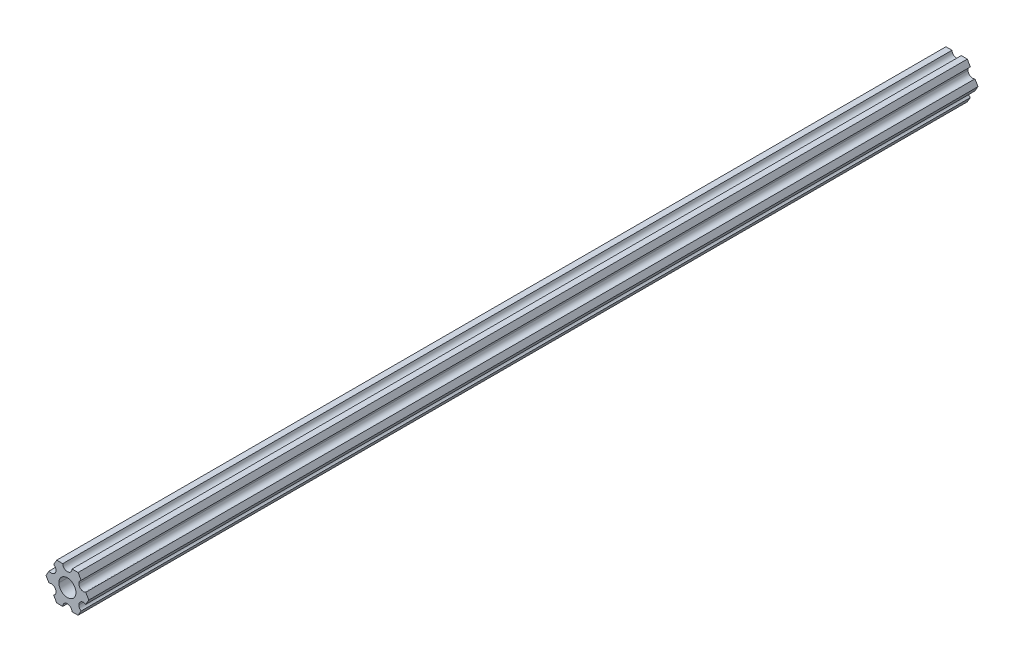
ISO-10303-21;
HEADER;
FILE_DESCRIPTION(('STEP AP214'),'2;1');
FILE_NAME('part.step','',(''),(''),'','','');
FILE_SCHEMA(('AUTOMOTIVE_DESIGN { 1 0 10303 214 1 1 1 1 }'));
ENDSEC;
DATA;
#1=APPLICATION_CONTEXT('core data for automotive mechanical design processes');
#2=APPLICATION_PROTOCOL_DEFINITION('international standard','automotive_design',2000,#1);
#3=PRODUCT_CONTEXT('',#1,'mechanical');
#4=PRODUCT('Part','Part','',(#3));
#5=PRODUCT_RELATED_PRODUCT_CATEGORY('part','',(#4));
#6=PRODUCT_DEFINITION_FORMATION('','',#4);
#7=PRODUCT_DEFINITION_CONTEXT('part definition',#1,'design');
#8=PRODUCT_DEFINITION('design','',#6,#7);
#9=PRODUCT_DEFINITION_SHAPE('','',#8);
#10=(LENGTH_UNIT() NAMED_UNIT(*) SI_UNIT(.MILLI.,.METRE.));
#11=(NAMED_UNIT(*) PLANE_ANGLE_UNIT() SI_UNIT($,.RADIAN.));
#12=(NAMED_UNIT(*) SI_UNIT($,.STERADIAN.) SOLID_ANGLE_UNIT());
#13=UNCERTAINTY_MEASURE_WITH_UNIT(LENGTH_MEASURE(1.E-05),#10,'distance_accuracy_value','');
#14=(GEOMETRIC_REPRESENTATION_CONTEXT(3) GLOBAL_UNCERTAINTY_ASSIGNED_CONTEXT((#13)) GLOBAL_UNIT_ASSIGNED_CONTEXT((#10,
#11,#12)) REPRESENTATION_CONTEXT('',''));
#15=CARTESIAN_POINT('',(0.,0.,0.));
#16=DIRECTION('',(0.,0.,1.));
#17=DIRECTION('',(1.,0.,0.));
#18=AXIS2_PLACEMENT_3D('',#15,#16,#17);
#19=CARTESIAN_POINT('',(0.,0.,304.8));
#20=DIRECTION('',(0.,0.,-1.));
#21=DIRECTION('',(-1.,0.,0.));
#22=AXIS2_PLACEMENT_3D('',#19,#20,#21);
#23=CYLINDRICAL_SURFACE('',#22,2.9337);
#24=DIRECTION('',(0.,0.,-1.));
#25=VECTOR('',#24,1.);
#26=CARTESIAN_POINT('',(2.9337,0.,304.8));
#27=LINE('',#26,#25);
#28=CARTESIAN_POINT('',(2.9337,0.,304.8));
#29=VERTEX_POINT('',#28);
#30=CARTESIAN_POINT('',(2.9337,0.,0.));
#31=VERTEX_POINT('',#30);
#32=EDGE_CURVE('E251',#29,#31,#27,.T.);
#33=ORIENTED_EDGE('',*,*,#32,.F.);
#34=CARTESIAN_POINT('',(0.,0.,304.8));
#35=DIRECTION('',(0.,0.,1.));
#36=DIRECTION('',(1.,0.,0.));
#37=AXIS2_PLACEMENT_3D('',#34,#35,#36);
#38=CIRCLE('',#37,2.9337);
#39=CARTESIAN_POINT('',(-2.9337,0.,304.8));
#40=VERTEX_POINT('',#39);
#41=EDGE_CURVE('E218',#29,#40,#38,.T.);
#42=ORIENTED_EDGE('',*,*,#41,.T.);
#43=DIRECTION('',(0.,0.,-1.));
#44=VECTOR('',#43,1.);
#45=CARTESIAN_POINT('',(-2.9337,0.,304.8));
#46=LINE('',#45,#44);
#47=CARTESIAN_POINT('',(-2.9337,0.,0.));
#48=VERTEX_POINT('',#47);
#49=EDGE_CURVE('E250',#40,#48,#46,.T.);
#50=ORIENTED_EDGE('',*,*,#49,.T.);
#51=CARTESIAN_POINT('',(0.,0.,0.));
#52=DIRECTION('',(0.,0.,1.));
#53=DIRECTION('',(1.,0.,0.));
#54=AXIS2_PLACEMENT_3D('',#51,#52,#53);
#55=CIRCLE('',#54,2.9337);
#56=EDGE_CURVE('E252',#31,#48,#55,.T.);
#57=ORIENTED_EDGE('',*,*,#56,.F.);
#58=EDGE_LOOP('',(#33,#42,#50,#57));
#59=FACE_BOUND('',#58,.T.);
#60=ADVANCED_FACE('F16',(#59),#23,.F.);
#61=CARTESIAN_POINT('',(5.49926150638082,-3.17499966684067,304.8));
#62=DIRECTION('',(0.,0.,-1.));
#63=DIRECTION('',(-1.,0.,0.));
#64=AXIS2_PLACEMENT_3D('',#61,#62,#63);
#65=CYLINDRICAL_SURFACE('',#64,1.5875);
#66=DIRECTION('',(0.,0.,-1.));
#67=VECTOR('',#66,1.);
#68=CARTESIAN_POINT('',(3.91176150638082,-3.17499966684067,304.8));
#69=LINE('',#68,#67);
#70=CARTESIAN_POINT('',(3.91176150638082,-3.17499966684067,304.8));
#71=VERTEX_POINT('',#70);
#72=CARTESIAN_POINT('',(3.91176150638082,-3.17499966684067,0.));
#73=VERTEX_POINT('',#72);
#74=EDGE_CURVE('E231',#71,#73,#69,.T.);
#75=ORIENTED_EDGE('',*,*,#74,.F.);
#76=CARTESIAN_POINT('',(5.49926150638082,-3.17499966684067,304.8));
#77=DIRECTION('',(0.,0.,-1.));
#78=DIRECTION('',(1.,0.,0.));
#79=AXIS2_PLACEMENT_3D('',#76,#77,#78);
#80=CIRCLE('',#79,1.5875);
#81=CARTESIAN_POINT('',(4.70551158967065,-4.54981504343587,304.8));
#82=VERTEX_POINT('',#81);
#83=EDGE_CURVE('E255',#82,#71,#80,.T.);
#84=ORIENTED_EDGE('',*,*,#83,.F.);
#85=DIRECTION('',(0.,0.,-1.));
#86=VECTOR('',#85,1.);
#87=CARTESIAN_POINT('',(4.70551158967065,-4.54981504343587,304.8));
#88=LINE('',#87,#86);
#89=CARTESIAN_POINT('',(4.70551158967065,-4.54981504343587,0.));
#90=VERTEX_POINT('',#89);
#91=EDGE_CURVE('E10',#82,#90,#88,.T.);
#92=ORIENTED_EDGE('',*,*,#91,.T.);
#93=CARTESIAN_POINT('',(5.49926150638082,-3.17499966684067,0.));
#94=DIRECTION('',(0.,0.,-1.));
#95=DIRECTION('',(1.,0.,0.));
#96=AXIS2_PLACEMENT_3D('',#93,#94,#95);
#97=CIRCLE('',#96,1.5875);
#98=EDGE_CURVE('E217',#90,#73,#97,.T.);
#99=ORIENTED_EDGE('',*,*,#98,.T.);
#100=EDGE_LOOP('',(#75,#84,#92,#99));
#101=FACE_BOUND('',#100,.T.);
#102=ADVANCED_FACE('F509',(#101),#65,.F.);
#103=CARTESIAN_POINT('',(3.66617459405346,-6.34999977789375,304.8));
#104=DIRECTION('',(-0.86602543407573,0.499999947533941,0.));
#105=DIRECTION('',(0.,0.,1.));
#106=AXIS2_PLACEMENT_3D('',#103,#104,#105);
#107=PLANE('',#106);
#108=DIRECTION('',(0.499999947533941,0.86602543407573,0.));
#109=VECTOR('',#108,1.);
#110=CARTESIAN_POINT('',(3.66617459405346,-6.34999977789375,0.));
#111=LINE('',#110,#109);
#112=CARTESIAN_POINT('',(3.66617459405346,-6.34999977789375,0.));
#113=VERTEX_POINT('',#112);
#114=EDGE_CURVE('E374',#113,#90,#111,.T.);
#115=ORIENTED_EDGE('',*,*,#114,.T.);
#116=ORIENTED_EDGE('',*,*,#91,.F.);
#117=DIRECTION('',(0.499999947533941,0.86602543407573,0.));
#118=VECTOR('',#117,1.);
#119=CARTESIAN_POINT('',(3.66617459405346,-6.34999977789375,304.8));
#120=LINE('',#119,#118);
#121=CARTESIAN_POINT('',(3.66617459405346,-6.34999977789375,304.8));
#122=VERTEX_POINT('',#121);
#123=EDGE_CURVE('E258',#122,#82,#120,.T.);
#124=ORIENTED_EDGE('',*,*,#123,.F.);
#125=DIRECTION('',(0.,0.,-1.));
#126=VECTOR('',#125,1.);
#127=CARTESIAN_POINT('',(3.66617459405346,-6.34999977789375,304.8));
#128=LINE('',#127,#126);
#129=EDGE_CURVE('E27',#122,#113,#128,.T.);
#130=ORIENTED_EDGE('',*,*,#129,.T.);
#131=EDGE_LOOP('',(#115,#116,#124,#130));
#132=FACE_BOUND('',#131,.T.);
#133=ADVANCED_FACE('F462',(#132),#107,.F.);
#134=CARTESIAN_POINT('',(1.58750038469926,-6.34999990382518,304.8));
#135=DIRECTION('',(-6.05825721258438E-08,1.,0.));
#136=DIRECTION('',(0.,0.,1.));
#137=AXIS2_PLACEMENT_3D('',#134,#135,#136);
#138=PLANE('',#137);
#139=DIRECTION('',(1.,6.05825721258438E-08,0.));
#140=VECTOR('',#139,1.);
#141=CARTESIAN_POINT('',(1.58750038469926,-6.34999990382518,0.));
#142=LINE('',#141,#140);
#143=CARTESIAN_POINT('',(1.58750038469926,-6.34999990382518,0.));
#144=VERTEX_POINT('',#143);
#145=EDGE_CURVE('E348',#144,#113,#142,.T.);
#146=ORIENTED_EDGE('',*,*,#145,.T.);
#147=ORIENTED_EDGE('',*,*,#129,.F.);
#148=DIRECTION('',(1.,6.05825721258438E-08,0.));
#149=VECTOR('',#148,1.);
#150=CARTESIAN_POINT('',(1.58750038469926,-6.34999990382518,304.8));
#151=LINE('',#150,#149);
#152=CARTESIAN_POINT('',(1.58750038469926,-6.34999990382518,304.8));
#153=VERTEX_POINT('',#152);
#154=EDGE_CURVE('E299',#153,#122,#151,.T.);
#155=ORIENTED_EDGE('',*,*,#154,.F.);
#156=DIRECTION('',(0.,0.,-1.));
#157=VECTOR('',#156,1.);
#158=CARTESIAN_POINT('',(1.58750038469926,-6.34999990382518,304.8));
#159=LINE('',#158,#157);
#160=EDGE_CURVE('E307',#153,#144,#159,.T.);
#161=ORIENTED_EDGE('',*,*,#160,.T.);
#162=EDGE_LOOP('',(#146,#147,#155,#161));
#163=FACE_BOUND('',#162,.T.);
#164=ADVANCED_FACE('F456',(#163),#138,.F.);
#165=CARTESIAN_POINT('',(3.8469926204343E-07,-6.35,304.8));
#166=DIRECTION('',(0.,0.,-1.));
#167=DIRECTION('',(-1.,0.,0.));
#168=AXIS2_PLACEMENT_3D('',#165,#166,#167);
#169=CYLINDRICAL_SURFACE('',#168,1.5875);
#170=CARTESIAN_POINT('',(3.8469926204343E-07,-6.35,0.));
#171=DIRECTION('',(0.,0.,-1.));
#172=DIRECTION('',(1.,0.,0.));
#173=AXIS2_PLACEMENT_3D('',#170,#171,#172);
#174=CIRCLE('',#173,1.5875);
#175=CARTESIAN_POINT('',(-1.58749961530073,-6.35000009617482,0.));
#176=VERTEX_POINT('',#175);
#177=EDGE_CURVE('E343',#176,#144,#174,.T.);
#178=ORIENTED_EDGE('',*,*,#177,.T.);
#179=ORIENTED_EDGE('',*,*,#160,.F.);
#180=CARTESIAN_POINT('',(3.8469926204343E-07,-6.35,304.8));
#181=DIRECTION('',(0.,0.,-1.));
#182=DIRECTION('',(1.,0.,0.));
#183=AXIS2_PLACEMENT_3D('',#180,#181,#182);
#184=CIRCLE('',#183,1.5875);
#185=CARTESIAN_POINT('',(-1.58749961530073,-6.35000009617482,304.8));
#186=VERTEX_POINT('',#185);
#187=EDGE_CURVE('E272',#186,#153,#184,.T.);
#188=ORIENTED_EDGE('',*,*,#187,.F.);
#189=DIRECTION('',(0.,0.,-1.));
#190=VECTOR('',#189,1.);
#191=CARTESIAN_POINT('',(-1.58749961530073,-6.35000009617482,304.8));
#192=LINE('',#191,#190);
#193=EDGE_CURVE('E382',#186,#176,#192,.T.);
#194=ORIENTED_EDGE('',*,*,#193,.T.);
#195=EDGE_LOOP('',(#178,#179,#188,#194));
#196=FACE_BOUND('',#195,.T.);
#197=ADVANCED_FACE('F497',(#196),#169,.F.);
#198=CARTESIAN_POINT('',(-3.66617382465481,-6.35000022210628,304.8));
#199=DIRECTION('',(-6.05825854783851E-08,1.,0.));
#200=DIRECTION('',(0.,0.,1.));
#201=AXIS2_PLACEMENT_3D('',#198,#199,#200);
#202=PLANE('',#201);
#203=DIRECTION('',(1.,6.05825854783851E-08,0.));
#204=VECTOR('',#203,1.);
#205=CARTESIAN_POINT('',(-3.66617382465481,-6.35000022210628,0.));
#206=LINE('',#205,#204);
#207=CARTESIAN_POINT('',(-3.66617382465481,-6.35000022210628,0.));
#208=VERTEX_POINT('',#207);
#209=EDGE_CURVE('E347',#208,#176,#206,.T.);
#210=ORIENTED_EDGE('',*,*,#209,.T.);
#211=ORIENTED_EDGE('',*,*,#193,.F.);
#212=DIRECTION('',(1.,6.05825854783851E-08,0.));
#213=VECTOR('',#212,1.);
#214=CARTESIAN_POINT('',(-3.66617382465481,-6.35000022210628,304.8));
#215=LINE('',#214,#213);
#216=CARTESIAN_POINT('',(-3.66617382465481,-6.35000022210628,304.8));
#217=VERTEX_POINT('',#216);
#218=EDGE_CURVE('E268',#217,#186,#215,.T.);
#219=ORIENTED_EDGE('',*,*,#218,.F.);
#220=DIRECTION('',(0.,0.,-1.));
#221=VECTOR('',#220,1.);
#222=CARTESIAN_POINT('',(-3.66617382465481,-6.35000022210628,304.8));
#223=LINE('',#222,#221);
#224=EDGE_CURVE('E422',#217,#208,#223,.T.);
#225=ORIENTED_EDGE('',*,*,#224,.T.);
#226=EDGE_LOOP('',(#210,#211,#219,#225));
#227=FACE_BOUND('',#226,.T.);
#228=ADVANCED_FACE('F490',(#227),#202,.F.);
#229=CARTESIAN_POINT('',(-4.70551103839172,-4.54981561357972,304.8));
#230=DIRECTION('',(0.866025373493152,0.500000052466045,0.));
#231=DIRECTION('',(0.,0.,-1.));
#232=AXIS2_PLACEMENT_3D('',#229,#230,#231);
#233=PLANE('',#232);
#234=DIRECTION('',(0.500000052466045,-0.866025373493152,0.));
#235=VECTOR('',#234,1.);
#236=CARTESIAN_POINT('',(-4.70551103839172,-4.54981561357972,0.));
#237=LINE('',#236,#235);
#238=CARTESIAN_POINT('',(-4.70551103839172,-4.54981561357972,0.));
#239=VERTEX_POINT('',#238);
#240=EDGE_CURVE('E321',#239,#208,#237,.T.);
#241=ORIENTED_EDGE('',*,*,#240,.T.);
#242=ORIENTED_EDGE('',*,*,#224,.F.);
#243=DIRECTION('',(0.500000052466045,-0.866025373493152,0.));
#244=VECTOR('',#243,1.);
#245=CARTESIAN_POINT('',(-4.70551103839172,-4.54981561357972,304.8));
#246=LINE('',#245,#244);
#247=CARTESIAN_POINT('',(-4.70551103839172,-4.54981561357972,304.8));
#248=VERTEX_POINT('',#247);
#249=EDGE_CURVE('E273',#248,#217,#246,.T.);
#250=ORIENTED_EDGE('',*,*,#249,.F.);
#251=DIRECTION('',(0.,0.,-1.));
#252=VECTOR('',#251,1.);
#253=CARTESIAN_POINT('',(-4.70551103839172,-4.54981561357972,304.8));
#254=LINE('',#253,#252);
#255=EDGE_CURVE('E311',#248,#239,#254,.T.);
#256=ORIENTED_EDGE('',*,*,#255,.T.);
#257=EDGE_LOOP('',(#241,#242,#250,#256));
#258=FACE_BOUND('',#257,.T.);
#259=ADVANCED_FACE('F486',(#258),#233,.F.);
#260=CARTESIAN_POINT('',(-5.49926112168156,-3.17500033315934,304.8));
#261=DIRECTION('',(0.,0.,-1.));
#262=DIRECTION('',(-1.,0.,0.));
#263=AXIS2_PLACEMENT_3D('',#260,#261,#262);
#264=CYLINDRICAL_SURFACE('',#263,1.5875);
#265=CARTESIAN_POINT('',(-5.49926112168156,-3.17500033315934,0.));
#266=DIRECTION('',(0.,0.,-1.));
#267=DIRECTION('',(1.,0.,0.));
#268=AXIS2_PLACEMENT_3D('',#265,#266,#267);
#269=CIRCLE('',#268,1.5875);
#270=CARTESIAN_POINT('',(-6.29301120497141,-1.80018505273897,0.));
#271=VERTEX_POINT('',#270);
#272=EDGE_CURVE('E317',#271,#239,#269,.T.);
#273=ORIENTED_EDGE('',*,*,#272,.T.);
#274=ORIENTED_EDGE('',*,*,#255,.F.);
#275=CARTESIAN_POINT('',(-5.49926112168156,-3.17500033315934,304.8));
#276=DIRECTION('',(0.,0.,-1.));
#277=DIRECTION('',(1.,0.,0.));
#278=AXIS2_PLACEMENT_3D('',#275,#276,#277);
#279=CIRCLE('',#278,1.5875);
#280=CARTESIAN_POINT('',(-6.29301120497141,-1.80018505273897,304.8));
#281=VERTEX_POINT('',#280);
#282=EDGE_CURVE('E390',#281,#248,#279,.T.);
#283=ORIENTED_EDGE('',*,*,#282,.F.);
#284=DIRECTION('',(0.,0.,-1.));
#285=VECTOR('',#284,1.);
#286=CARTESIAN_POINT('',(-6.29301120497141,-1.80018505273897,304.8));
#287=LINE('',#286,#285);
#288=EDGE_CURVE('E308',#281,#271,#287,.T.);
#289=ORIENTED_EDGE('',*,*,#288,.T.);
#290=EDGE_LOOP('',(#273,#274,#283,#289));
#291=FACE_BOUND('',#290,.T.);
#292=ADVANCED_FACE('F494',(#291),#264,.F.);
#293=CARTESIAN_POINT('',(-7.33234841870827,-4.44212523790841E-07,304.8));
#294=DIRECTION('',(0.866025373493151,0.500000052466045,0.));
#295=DIRECTION('',(0.,0.,-1.));
#296=AXIS2_PLACEMENT_3D('',#293,#294,#295);
#297=PLANE('',#296);
#298=DIRECTION('',(0.500000052466045,-0.866025373493151,0.));
#299=VECTOR('',#298,1.);
#300=CARTESIAN_POINT('',(-7.33234841870827,-4.44212523790841E-07,0.));
#301=LINE('',#300,#299);
#302=CARTESIAN_POINT('',(-7.33234841870827,-4.44212523790841E-07,0.));
#303=VERTEX_POINT('',#302);
#304=EDGE_CURVE('E279',#303,#271,#301,.T.);
#305=ORIENTED_EDGE('',*,*,#304,.T.);
#306=ORIENTED_EDGE('',*,*,#288,.F.);
#307=DIRECTION('',(0.500000052466045,-0.866025373493151,0.));
#308=VECTOR('',#307,1.);
#309=CARTESIAN_POINT('',(-7.33234841870827,-4.44212523790841E-07,304.8));
#310=LINE('',#309,#308);
#311=CARTESIAN_POINT('',(-7.33234841870827,-4.44212523790841E-07,304.8));
#312=VERTEX_POINT('',#311);
#313=EDGE_CURVE('E290',#312,#281,#310,.T.);
#314=ORIENTED_EDGE('',*,*,#313,.F.);
#315=DIRECTION('',(0.,0.,-1.));
#316=VECTOR('',#315,1.);
#317=CARTESIAN_POINT('',(-7.33234841870827,-4.44212523790841E-07,304.8));
#318=LINE('',#317,#316);
#319=EDGE_CURVE('E266',#312,#303,#318,.T.);
#320=ORIENTED_EDGE('',*,*,#319,.T.);
#321=EDGE_LOOP('',(#305,#306,#314,#320));
#322=FACE_BOUND('',#321,.T.);
#323=ADVANCED_FACE('F536',(#322),#297,.F.);
#324=CARTESIAN_POINT('',(-6.29301142309098,1.80018429024547,304.8));
#325=DIRECTION('',(0.866025434075724,-0.499999947533952,0.));
#326=DIRECTION('',(0.,0.,-1.));
#327=AXIS2_PLACEMENT_3D('',#324,#325,#326);
#328=PLANE('',#327);
#329=DIRECTION('',(-0.499999947533951,-0.866025434075724,0.));
#330=VECTOR('',#329,1.);
#331=CARTESIAN_POINT('',(-6.29301142309098,1.80018429024547,0.));
#332=LINE('',#331,#330);
#333=CARTESIAN_POINT('',(-6.29301142309098,1.80018429024547,0.));
#334=VERTEX_POINT('',#333);
#335=EDGE_CURVE('E274',#334,#303,#332,.T.);
#336=ORIENTED_EDGE('',*,*,#335,.T.);
#337=ORIENTED_EDGE('',*,*,#319,.F.);
#338=DIRECTION('',(-0.499999947533951,-0.866025434075724,0.));
#339=VECTOR('',#338,1.);
#340=CARTESIAN_POINT('',(-6.29301142309098,1.80018429024547,304.8));
#341=LINE('',#340,#339);
#342=CARTESIAN_POINT('',(-6.29301142309098,1.80018429024547,304.8));
#343=VERTEX_POINT('',#342);
#344=EDGE_CURVE('E286',#343,#312,#341,.T.);
#345=ORIENTED_EDGE('',*,*,#344,.F.);
#346=DIRECTION('',(0.,0.,-1.));
#347=VECTOR('',#346,1.);
#348=CARTESIAN_POINT('',(-6.29301142309098,1.80018429024547,304.8));
#349=LINE('',#348,#347);
#350=EDGE_CURVE('E263',#343,#334,#349,.T.);
#351=ORIENTED_EDGE('',*,*,#350,.T.);
#352=EDGE_LOOP('',(#336,#337,#345,#351));
#353=FACE_BOUND('',#352,.T.);
#354=ADVANCED_FACE('F532',(#353),#328,.F.);
#355=CARTESIAN_POINT('',(-5.49926150638082,3.17499966684067,304.8));
#356=DIRECTION('',(0.,0.,-1.));
#357=DIRECTION('',(-1.,0.,0.));
#358=AXIS2_PLACEMENT_3D('',#355,#356,#357);
#359=CYLINDRICAL_SURFACE('',#358,1.5875);
#360=CARTESIAN_POINT('',(-5.49926150638082,3.17499966684067,0.));
#361=DIRECTION('',(0.,0.,-1.));
#362=DIRECTION('',(1.,0.,0.));
#363=AXIS2_PLACEMENT_3D('',#360,#361,#362);
#364=CIRCLE('',#363,1.5875);
#365=CARTESIAN_POINT('',(-4.70551158967065,4.54981504343587,0.));
#366=VERTEX_POINT('',#365);
#367=EDGE_CURVE('E278',#366,#334,#364,.T.);
#368=ORIENTED_EDGE('',*,*,#367,.T.);
#369=ORIENTED_EDGE('',*,*,#350,.F.);
#370=CARTESIAN_POINT('',(-5.49926150638082,3.17499966684067,304.8));
#371=DIRECTION('',(0.,0.,-1.));
#372=DIRECTION('',(1.,0.,0.));
#373=AXIS2_PLACEMENT_3D('',#370,#371,#372);
#374=CIRCLE('',#373,1.5875);
#375=CARTESIAN_POINT('',(-4.70551158967065,4.54981504343587,304.8));
#376=VERTEX_POINT('',#375);
#377=EDGE_CURVE('E291',#376,#343,#374,.T.);
#378=ORIENTED_EDGE('',*,*,#377,.F.);
#379=DIRECTION('',(0.,0.,-1.));
#380=VECTOR('',#379,1.);
#381=CARTESIAN_POINT('',(-4.70551158967065,4.54981504343587,304.8));
#382=LINE('',#381,#380);
#383=EDGE_CURVE('E267',#376,#366,#382,.T.);
#384=ORIENTED_EDGE('',*,*,#383,.T.);
#385=EDGE_LOOP('',(#368,#369,#378,#384));
#386=FACE_BOUND('',#385,.T.);
#387=ADVANCED_FACE('F535',(#386),#359,.F.);
#388=CARTESIAN_POINT('',(-3.66617459405349,6.3499997778937,304.8));
#389=DIRECTION('',(0.866025434075729,-0.499999947533942,0.));
#390=DIRECTION('',(0.,0.,-1.));
#391=AXIS2_PLACEMENT_3D('',#388,#389,#390);
#392=PLANE('',#391);
#393=DIRECTION('',(-0.499999947533943,-0.866025434075729,0.));
#394=VECTOR('',#393,1.);
#395=CARTESIAN_POINT('',(-3.66617459405349,6.3499997778937,0.));
#396=LINE('',#395,#394);
#397=CARTESIAN_POINT('',(-3.66617459405349,6.3499997778937,0.));
#398=VERTEX_POINT('',#397);
#399=EDGE_CURVE('E316',#398,#366,#396,.T.);
#400=ORIENTED_EDGE('',*,*,#399,.T.);
#401=ORIENTED_EDGE('',*,*,#383,.F.);
#402=DIRECTION('',(-0.499999947533943,-0.866025434075729,0.));
#403=VECTOR('',#402,1.);
#404=CARTESIAN_POINT('',(-3.66617459405349,6.3499997778937,304.8));
#405=LINE('',#404,#403);
#406=CARTESIAN_POINT('',(-3.66617459405349,6.3499997778937,304.8));
#407=VERTEX_POINT('',#406);
#408=EDGE_CURVE('E341',#407,#376,#405,.T.);
#409=ORIENTED_EDGE('',*,*,#408,.F.);
#410=DIRECTION('',(0.,0.,-1.));
#411=VECTOR('',#410,1.);
#412=CARTESIAN_POINT('',(-3.66617459405349,6.3499997778937,304.8));
#413=LINE('',#412,#411);
#414=EDGE_CURVE('E389',#407,#398,#413,.T.);
#415=ORIENTED_EDGE('',*,*,#414,.T.);
#416=EDGE_LOOP('',(#400,#401,#409,#415));
#417=FACE_BOUND('',#416,.T.);
#418=ADVANCED_FACE('F562',(#417),#392,.F.);
#419=CARTESIAN_POINT('',(-1.58750038469926,6.34999990382518,304.8));
#420=DIRECTION('',(6.05825963273174E-08,-1.,0.));
#421=DIRECTION('',(0.,0.,-1.));
#422=AXIS2_PLACEMENT_3D('',#419,#420,#421);
#423=PLANE('',#422);
#424=DIRECTION('',(-1.,-6.05825963273174E-08,0.));
#425=VECTOR('',#424,1.);
#426=CARTESIAN_POINT('',(-1.58750038469926,6.34999990382518,0.));
#427=LINE('',#426,#425);
#428=CARTESIAN_POINT('',(-1.58750038469926,6.34999990382519,0.));
#429=VERTEX_POINT('',#428);
#430=EDGE_CURVE('E312',#429,#398,#427,.T.);
#431=ORIENTED_EDGE('',*,*,#430,.T.);
#432=ORIENTED_EDGE('',*,*,#414,.F.);
#433=DIRECTION('',(-1.,-6.05825963273174E-08,0.));
#434=VECTOR('',#433,1.);
#435=CARTESIAN_POINT('',(-1.58750038469926,6.34999990382518,304.8));
#436=LINE('',#435,#434);
#437=CARTESIAN_POINT('',(-1.58750038469926,6.34999990382519,304.8));
#438=VERTEX_POINT('',#437);
#439=EDGE_CURVE('E337',#438,#407,#436,.T.);
#440=ORIENTED_EDGE('',*,*,#439,.F.);
#441=DIRECTION('',(0.,0.,-1.));
#442=VECTOR('',#441,1.);
#443=CARTESIAN_POINT('',(-1.58750038469926,6.34999990382519,304.8));
#444=LINE('',#443,#442);
#445=EDGE_CURVE('E304',#438,#429,#444,.T.);
#446=ORIENTED_EDGE('',*,*,#445,.T.);
#447=EDGE_LOOP('',(#431,#432,#440,#446));
#448=FACE_BOUND('',#447,.T.);
#449=ADVANCED_FACE('F558',(#448),#423,.F.);
#450=CARTESIAN_POINT('',(-3.84699260060323E-07,6.35,304.8));
#451=DIRECTION('',(0.,0.,-1.));
#452=DIRECTION('',(-1.,0.,0.));
#453=AXIS2_PLACEMENT_3D('',#450,#451,#452);
#454=CYLINDRICAL_SURFACE('',#453,1.5875);
#455=CARTESIAN_POINT('',(-3.84699260060323E-07,6.35,0.));
#456=DIRECTION('',(0.,0.,-1.));
#457=DIRECTION('',(1.,0.,0.));
#458=AXIS2_PLACEMENT_3D('',#455,#456,#457);
#459=CIRCLE('',#458,1.5875);
#460=CARTESIAN_POINT('',(1.58749961530074,6.35000009617482,0.));
#461=VERTEX_POINT('',#460);
#462=EDGE_CURVE('E245',#461,#429,#459,.T.);
#463=ORIENTED_EDGE('',*,*,#462,.T.);
#464=ORIENTED_EDGE('',*,*,#445,.F.);
#465=CARTESIAN_POINT('',(-3.84699260060323E-07,6.35,304.8));
#466=DIRECTION('',(0.,0.,-1.));
#467=DIRECTION('',(1.,0.,0.));
#468=AXIS2_PLACEMENT_3D('',#465,#466,#467);
#469=CIRCLE('',#468,1.5875);
#470=CARTESIAN_POINT('',(1.58749961530074,6.35000009617482,304.8));
#471=VERTEX_POINT('',#470);
#472=EDGE_CURVE('E342',#471,#438,#469,.T.);
#473=ORIENTED_EDGE('',*,*,#472,.F.);
#474=DIRECTION('',(0.,0.,-1.));
#475=VECTOR('',#474,1.);
#476=CARTESIAN_POINT('',(1.58749961530074,6.35000009617482,304.8));
#477=LINE('',#476,#475);
#478=EDGE_CURVE('E262',#471,#461,#477,.T.);
#479=ORIENTED_EDGE('',*,*,#478,.T.);
#480=EDGE_LOOP('',(#463,#464,#473,#479));
#481=FACE_BOUND('',#480,.T.);
#482=ADVANCED_FACE('F555',(#481),#454,.F.);
#483=CARTESIAN_POINT('',(3.66617382465481,6.35000022210627,304.8));
#484=DIRECTION('',(6.05825850611185E-08,-1.,0.));
#485=DIRECTION('',(0.,0.,-1.));
#486=AXIS2_PLACEMENT_3D('',#483,#484,#485);
#487=PLANE('',#486);
#488=DIRECTION('',(-1.,-6.05825850611185E-08,0.));
#489=VECTOR('',#488,1.);
#490=CARTESIAN_POINT('',(3.66617382465481,6.35000022210627,0.));
#491=LINE('',#490,#489);
#492=CARTESIAN_POINT('',(3.66617382465481,6.35000022210627,0.));
#493=VERTEX_POINT('',#492);
#494=EDGE_CURVE('E240',#493,#461,#491,.T.);
#495=ORIENTED_EDGE('',*,*,#494,.T.);
#496=ORIENTED_EDGE('',*,*,#478,.F.);
#497=DIRECTION('',(-1.,-6.05825850611185E-08,0.));
#498=VECTOR('',#497,1.);
#499=CARTESIAN_POINT('',(3.66617382465481,6.35000022210627,304.8));
#500=LINE('',#499,#498);
#501=CARTESIAN_POINT('',(3.66617382465481,6.35000022210627,304.8));
#502=VERTEX_POINT('',#501);
#503=EDGE_CURVE('E361',#502,#471,#500,.T.);
#504=ORIENTED_EDGE('',*,*,#503,.F.);
#505=DIRECTION('',(0.,0.,-1.));
#506=VECTOR('',#505,1.);
#507=CARTESIAN_POINT('',(3.66617382465481,6.35000022210627,304.8));
#508=LINE('',#507,#506);
#509=EDGE_CURVE('E259',#502,#493,#508,.T.);
#510=ORIENTED_EDGE('',*,*,#509,.T.);
#511=EDGE_LOOP('',(#495,#496,#504,#510));
#512=FACE_BOUND('',#511,.T.);
#513=ADVANCED_FACE('F521',(#512),#487,.F.);
#514=CARTESIAN_POINT('',(4.70551103839172,4.54981561357972,304.8));
#515=DIRECTION('',(-0.866025373493151,-0.500000052466046,0.));
#516=DIRECTION('',(-0.500000052466046,0.866025373493151,0.));
#517=AXIS2_PLACEMENT_3D('',#514,#515,#516);
#518=PLANE('',#517);
#519=DIRECTION('',(-0.500000052466046,0.866025373493151,0.));
#520=VECTOR('',#519,1.);
#521=CARTESIAN_POINT('',(4.70551103839172,4.54981561357972,0.));
#522=LINE('',#521,#520);
#523=CARTESIAN_POINT('',(4.70551103839172,4.54981561357972,0.));
#524=VERTEX_POINT('',#523);
#525=EDGE_CURVE('E244',#524,#493,#522,.T.);
#526=ORIENTED_EDGE('',*,*,#525,.T.);
#527=ORIENTED_EDGE('',*,*,#509,.F.);
#528=DIRECTION('',(-0.500000052466046,0.866025373493151,0.));
#529=VECTOR('',#528,1.);
#530=CARTESIAN_POINT('',(4.70551103839172,4.54981561357972,304.8));
#531=LINE('',#530,#529);
#532=CARTESIAN_POINT('',(4.70551103839172,4.54981561357972,304.8));
#533=VERTEX_POINT('',#532);
#534=EDGE_CURVE('E358',#533,#502,#531,.T.);
#535=ORIENTED_EDGE('',*,*,#534,.F.);
#536=DIRECTION('',(0.,0.,-1.));
#537=VECTOR('',#536,1.);
#538=CARTESIAN_POINT('',(4.70551103839172,4.54981561357972,304.8));
#539=LINE('',#538,#537);
#540=EDGE_CURVE('E336',#533,#524,#539,.T.);
#541=ORIENTED_EDGE('',*,*,#540,.T.);
#542=EDGE_LOOP('',(#526,#527,#535,#541));
#543=FACE_BOUND('',#542,.T.);
#544=ADVANCED_FACE('F517',(#543),#518,.F.);
#545=CARTESIAN_POINT('',(5.49926112168156,3.17500033315934,304.8));
#546=DIRECTION('',(0.,0.,-1.));
#547=DIRECTION('',(-1.,0.,0.));
#548=AXIS2_PLACEMENT_3D('',#545,#546,#547);
#549=CYLINDRICAL_SURFACE('',#548,1.5875);
#550=DIRECTION('',(0.,0.,-1.));
#551=VECTOR('',#550,1.);
#552=CARTESIAN_POINT('',(3.91176112168156,3.17500033315934,304.8));
#553=LINE('',#552,#551);
#554=CARTESIAN_POINT('',(3.91176112168156,3.17500033315934,304.8));
#555=VERTEX_POINT('',#554);
#556=CARTESIAN_POINT('',(3.91176112168156,3.17500033315934,0.));
#557=VERTEX_POINT('',#556);
#558=EDGE_CURVE('E325',#555,#557,#553,.T.);
#559=ORIENTED_EDGE('',*,*,#558,.F.);
#560=CARTESIAN_POINT('',(5.49926112168156,3.17500033315934,304.8));
#561=DIRECTION('',(0.,0.,-1.));
#562=DIRECTION('',(1.,0.,0.));
#563=AXIS2_PLACEMENT_3D('',#560,#561,#562);
#564=CIRCLE('',#563,1.5875);
#565=CARTESIAN_POINT('',(6.29301120497139,1.80018505273894,304.8));
#566=VERTEX_POINT('',#565);
#567=EDGE_CURVE('E362',#566,#555,#564,.T.);
#568=ORIENTED_EDGE('',*,*,#567,.F.);
#569=DIRECTION('',(0.,0.,-1.));
#570=VECTOR('',#569,1.);
#571=CARTESIAN_POINT('',(6.29301120497139,1.80018505273894,304.8));
#572=LINE('',#571,#570);
#573=CARTESIAN_POINT('',(6.29301120497139,1.80018505273894,0.));
#574=VERTEX_POINT('',#573);
#575=EDGE_CURVE('E42',#566,#574,#572,.T.);
#576=ORIENTED_EDGE('',*,*,#575,.T.);
#577=CARTESIAN_POINT('',(5.49926112168156,3.17500033315934,0.));
#578=DIRECTION('',(0.,0.,-1.));
#579=DIRECTION('',(1.,0.,0.));
#580=AXIS2_PLACEMENT_3D('',#577,#578,#579);
#581=CIRCLE('',#580,1.5875);
#582=EDGE_CURVE('E295',#574,#557,#581,.T.);
#583=ORIENTED_EDGE('',*,*,#582,.T.);
#584=EDGE_LOOP('',(#559,#568,#576,#583));
#585=FACE_BOUND('',#584,.T.);
#586=ADVANCED_FACE('F520',(#585),#549,.F.);
#587=CARTESIAN_POINT('',(7.33234841870827,4.44212519169686E-07,304.8));
#588=DIRECTION('',(-0.866025373493145,-0.500000052466057,0.));
#589=DIRECTION('',(-0.500000052466057,0.866025373493145,0.));
#590=AXIS2_PLACEMENT_3D('',#587,#588,#589);
#591=PLANE('',#590);
#592=DIRECTION('',(-0.500000052466056,0.866025373493145,0.));
#593=VECTOR('',#592,1.);
#594=CARTESIAN_POINT('',(7.33234841870827,4.44212519169686E-07,0.));
#595=LINE('',#594,#593);
#596=CARTESIAN_POINT('',(7.33234841870827,4.44212519169686E-07,0.));
#597=VERTEX_POINT('',#596);
#598=EDGE_CURVE('E214',#597,#574,#595,.T.);
#599=ORIENTED_EDGE('',*,*,#598,.T.);
#600=ORIENTED_EDGE('',*,*,#575,.F.);
#601=DIRECTION('',(-0.500000052466056,0.866025373493145,0.));
#602=VECTOR('',#601,1.);
#603=CARTESIAN_POINT('',(7.33234841870827,4.44212519169686E-07,304.8));
#604=LINE('',#603,#602);
#605=CARTESIAN_POINT('',(7.33234841870827,4.44212519169686E-07,304.8));
#606=VERTEX_POINT('',#605);
#607=EDGE_CURVE('E383',#606,#566,#604,.T.);
#608=ORIENTED_EDGE('',*,*,#607,.F.);
#609=DIRECTION('',(0.,0.,-1.));
#610=VECTOR('',#609,1.);
#611=CARTESIAN_POINT('',(7.33234841870827,4.44212519169686E-07,304.8));
#612=LINE('',#611,#610);
#613=EDGE_CURVE('E157',#606,#597,#612,.T.);
#614=ORIENTED_EDGE('',*,*,#613,.T.);
#615=EDGE_LOOP('',(#599,#600,#608,#614));
#616=FACE_BOUND('',#615,.T.);
#617=ADVANCED_FACE('F527',(#616),#591,.F.);
#618=CARTESIAN_POINT('',(6.29301142309098,-1.80018429024546,304.8));
#619=DIRECTION('',(-0.866025434075723,0.499999947533953,0.));
#620=DIRECTION('',(0.,0.,1.));
#621=AXIS2_PLACEMENT_3D('',#618,#619,#620);
#622=PLANE('',#621);
#623=DIRECTION('',(0.499999947533953,0.866025434075723,0.));
#624=VECTOR('',#623,1.);
#625=CARTESIAN_POINT('',(6.29301142309098,-1.80018429024546,0.));
#626=LINE('',#625,#624);
#627=CARTESIAN_POINT('',(6.29301142309098,-1.80018429024546,0.));
#628=VERTEX_POINT('',#627);
#629=EDGE_CURVE('E206',#628,#597,#626,.T.);
#630=ORIENTED_EDGE('',*,*,#629,.T.);
#631=ORIENTED_EDGE('',*,*,#613,.F.);
#632=DIRECTION('',(0.499999947533953,0.866025434075723,0.));
#633=VECTOR('',#632,1.);
#634=CARTESIAN_POINT('',(6.29301142309098,-1.80018429024546,304.8));
#635=LINE('',#634,#633);
#636=CARTESIAN_POINT('',(6.29301142309098,-1.80018429024546,304.8));
#637=VERTEX_POINT('',#636);
#638=EDGE_CURVE('E223',#637,#606,#635,.T.);
#639=ORIENTED_EDGE('',*,*,#638,.F.);
#640=DIRECTION('',(0.,0.,-1.));
#641=VECTOR('',#640,1.);
#642=CARTESIAN_POINT('',(6.29301142309098,-1.80018429024546,304.8));
#643=LINE('',#642,#641);
#644=EDGE_CURVE('E20',#637,#628,#643,.T.);
#645=ORIENTED_EDGE('',*,*,#644,.T.);
#646=EDGE_LOOP('',(#630,#631,#639,#645));
#647=FACE_BOUND('',#646,.T.);
#648=ADVANCED_FACE('F221',(#647),#622,.F.);
#649=CARTESIAN_POINT('',(5.49926112168156,3.17500033315934,0.));
#650=DIRECTION('',(0.,0.,1.));
#651=DIRECTION('',(1.,0.,0.));
#652=AXIS2_PLACEMENT_3D('',#649,#650,#651);
#653=PLANE('',#652);
#654=CARTESIAN_POINT('',(0.,0.,0.));
#655=DIRECTION('',(0.,0.,1.));
#656=DIRECTION('',(1.,0.,0.));
#657=AXIS2_PLACEMENT_3D('',#654,#655,#656);
#658=CIRCLE('',#657,2.9337);
#659=EDGE_CURVE('E246',#48,#31,#658,.T.);
#660=ORIENTED_EDGE('',*,*,#659,.T.);
#661=ORIENTED_EDGE('',*,*,#56,.T.);
#662=EDGE_LOOP('',(#660,#661));
#663=FACE_BOUND('',#662,.T.);
#664=ORIENTED_EDGE('',*,*,#629,.F.);
#665=CARTESIAN_POINT('',(5.49926150638082,-3.17499966684067,0.));
#666=DIRECTION('',(0.,0.,-1.));
#667=DIRECTION('',(1.,0.,0.));
#668=AXIS2_PLACEMENT_3D('',#665,#666,#667);
#669=CIRCLE('',#668,1.5875);
#670=EDGE_CURVE('E211',#73,#628,#669,.T.);
#671=ORIENTED_EDGE('',*,*,#670,.F.);
#672=ORIENTED_EDGE('',*,*,#98,.F.);
#673=ORIENTED_EDGE('',*,*,#114,.F.);
#674=ORIENTED_EDGE('',*,*,#145,.F.);
#675=ORIENTED_EDGE('',*,*,#177,.F.);
#676=ORIENTED_EDGE('',*,*,#209,.F.);
#677=ORIENTED_EDGE('',*,*,#240,.F.);
#678=ORIENTED_EDGE('',*,*,#272,.F.);
#679=ORIENTED_EDGE('',*,*,#304,.F.);
#680=ORIENTED_EDGE('',*,*,#335,.F.);
#681=ORIENTED_EDGE('',*,*,#367,.F.);
#682=ORIENTED_EDGE('',*,*,#399,.F.);
#683=ORIENTED_EDGE('',*,*,#430,.F.);
#684=ORIENTED_EDGE('',*,*,#462,.F.);
#685=ORIENTED_EDGE('',*,*,#494,.F.);
#686=ORIENTED_EDGE('',*,*,#525,.F.);
#687=CARTESIAN_POINT('',(5.49926112168156,3.17500033315934,0.));
#688=DIRECTION('',(0.,0.,-1.));
#689=DIRECTION('',(1.,0.,0.));
#690=AXIS2_PLACEMENT_3D('',#687,#688,#689);
#691=CIRCLE('',#690,1.5875);
#692=EDGE_CURVE('E332',#557,#524,#691,.T.);
#693=ORIENTED_EDGE('',*,*,#692,.F.);
#694=ORIENTED_EDGE('',*,*,#582,.F.);
#695=ORIENTED_EDGE('',*,*,#598,.F.);
#696=EDGE_LOOP('',(#664,#671,#672,#673,#674,#675,#676,#677,#678,#679,#680,#681,#682,#683,#684,
#685,#686,#693,#694,#695));
#697=FACE_BOUND('',#696,.T.);
#698=ADVANCED_FACE('F208',(#663,#697),#653,.F.);
#699=CARTESIAN_POINT('',(5.49926112168156,3.17500033315934,304.8));
#700=DIRECTION('',(0.,0.,1.));
#701=DIRECTION('',(1.,0.,0.));
#702=AXIS2_PLACEMENT_3D('',#699,#700,#701);
#703=PLANE('',#702);
#704=CARTESIAN_POINT('',(0.,0.,304.8));
#705=DIRECTION('',(0.,0.,1.));
#706=DIRECTION('',(1.,0.,0.));
#707=AXIS2_PLACEMENT_3D('',#704,#705,#706);
#708=CIRCLE('',#707,2.9337);
#709=EDGE_CURVE('E285',#40,#29,#708,.T.);
#710=ORIENTED_EDGE('',*,*,#709,.F.);
#711=ORIENTED_EDGE('',*,*,#41,.F.);
#712=EDGE_LOOP('',(#710,#711));
#713=FACE_BOUND('',#712,.T.);
#714=ORIENTED_EDGE('',*,*,#638,.T.);
#715=ORIENTED_EDGE('',*,*,#607,.T.);
#716=ORIENTED_EDGE('',*,*,#567,.T.);
#717=CARTESIAN_POINT('',(5.49926112168156,3.17500033315934,304.8));
#718=DIRECTION('',(0.,0.,-1.));
#719=DIRECTION('',(1.,0.,0.));
#720=AXIS2_PLACEMENT_3D('',#717,#718,#719);
#721=CIRCLE('',#720,1.5875);
#722=EDGE_CURVE('E228',#555,#533,#721,.T.);
#723=ORIENTED_EDGE('',*,*,#722,.T.);
#724=ORIENTED_EDGE('',*,*,#534,.T.);
#725=ORIENTED_EDGE('',*,*,#503,.T.);
#726=ORIENTED_EDGE('',*,*,#472,.T.);
#727=ORIENTED_EDGE('',*,*,#439,.T.);
#728=ORIENTED_EDGE('',*,*,#408,.T.);
#729=ORIENTED_EDGE('',*,*,#377,.T.);
#730=ORIENTED_EDGE('',*,*,#344,.T.);
#731=ORIENTED_EDGE('',*,*,#313,.T.);
#732=ORIENTED_EDGE('',*,*,#282,.T.);
#733=ORIENTED_EDGE('',*,*,#249,.T.);
#734=ORIENTED_EDGE('',*,*,#218,.T.);
#735=ORIENTED_EDGE('',*,*,#187,.T.);
#736=ORIENTED_EDGE('',*,*,#154,.T.);
#737=ORIENTED_EDGE('',*,*,#123,.T.);
#738=ORIENTED_EDGE('',*,*,#83,.T.);
#739=CARTESIAN_POINT('',(5.49926150638082,-3.17499966684067,304.8));
#740=DIRECTION('',(0.,0.,-1.));
#741=DIRECTION('',(1.,0.,0.));
#742=AXIS2_PLACEMENT_3D('',#739,#740,#741);
#743=CIRCLE('',#742,1.5875);
#744=EDGE_CURVE('E237',#71,#637,#743,.T.);
#745=ORIENTED_EDGE('',*,*,#744,.T.);
#746=EDGE_LOOP('',(#714,#715,#716,#723,#724,#725,#726,#727,#728,#729,#730,#731,#732,#733,#734,
#735,#736,#737,#738,#745));
#747=FACE_BOUND('',#746,.T.);
#748=ADVANCED_FACE('F464',(#713,#747),#703,.T.);
#749=CARTESIAN_POINT('',(5.49926112168156,3.17500033315934,304.8));
#750=DIRECTION('',(0.,0.,-1.));
#751=DIRECTION('',(-1.,0.,0.));
#752=AXIS2_PLACEMENT_3D('',#749,#750,#751);
#753=CYLINDRICAL_SURFACE('',#752,1.5875);
#754=ORIENTED_EDGE('',*,*,#722,.F.);
#755=ORIENTED_EDGE('',*,*,#558,.T.);
#756=ORIENTED_EDGE('',*,*,#692,.T.);
#757=ORIENTED_EDGE('',*,*,#540,.F.);
#758=EDGE_LOOP('',(#754,#755,#756,#757));
#759=FACE_BOUND('',#758,.T.);
#760=ADVANCED_FACE('F18',(#759),#753,.F.);
#761=CARTESIAN_POINT('',(5.49926150638082,-3.17499966684067,304.8));
#762=DIRECTION('',(0.,0.,-1.));
#763=DIRECTION('',(-1.,0.,0.));
#764=AXIS2_PLACEMENT_3D('',#761,#762,#763);
#765=CYLINDRICAL_SURFACE('',#764,1.5875);
#766=ORIENTED_EDGE('',*,*,#744,.F.);
#767=ORIENTED_EDGE('',*,*,#74,.T.);
#768=ORIENTED_EDGE('',*,*,#670,.T.);
#769=ORIENTED_EDGE('',*,*,#644,.F.);
#770=EDGE_LOOP('',(#766,#767,#768,#769));
#771=FACE_BOUND('',#770,.T.);
#772=ADVANCED_FACE('F229',(#771),#765,.F.);
#773=CARTESIAN_POINT('',(0.,0.,304.8));
#774=DIRECTION('',(0.,0.,-1.));
#775=DIRECTION('',(-1.,0.,0.));
#776=AXIS2_PLACEMENT_3D('',#773,#774,#775);
#777=CYLINDRICAL_SURFACE('',#776,2.9337);
#778=ORIENTED_EDGE('',*,*,#709,.T.);
#779=ORIENTED_EDGE('',*,*,#32,.T.);
#780=ORIENTED_EDGE('',*,*,#659,.F.);
#781=ORIENTED_EDGE('',*,*,#49,.F.);
#782=EDGE_LOOP('',(#778,#779,#780,#781));
#783=FACE_BOUND('',#782,.T.);
#784=ADVANCED_FACE('F528',(#783),#777,.F.);
#785=CLOSED_SHELL('',(#60,#102,#133,#164,#197,#228,#259,#292,#323,#354,#387,#418,#449,#482,#513,
#544,#586,#617,#648,#698,#748,#760,#772,#784));
#786=MANIFOLD_SOLID_BREP('B1',#785);
#787=ADVANCED_BREP_SHAPE_REPRESENTATION('',(#18,#786),#14);
#788=SHAPE_DEFINITION_REPRESENTATION(#9,#787);
ENDSEC;
END-ISO-10303-21;
